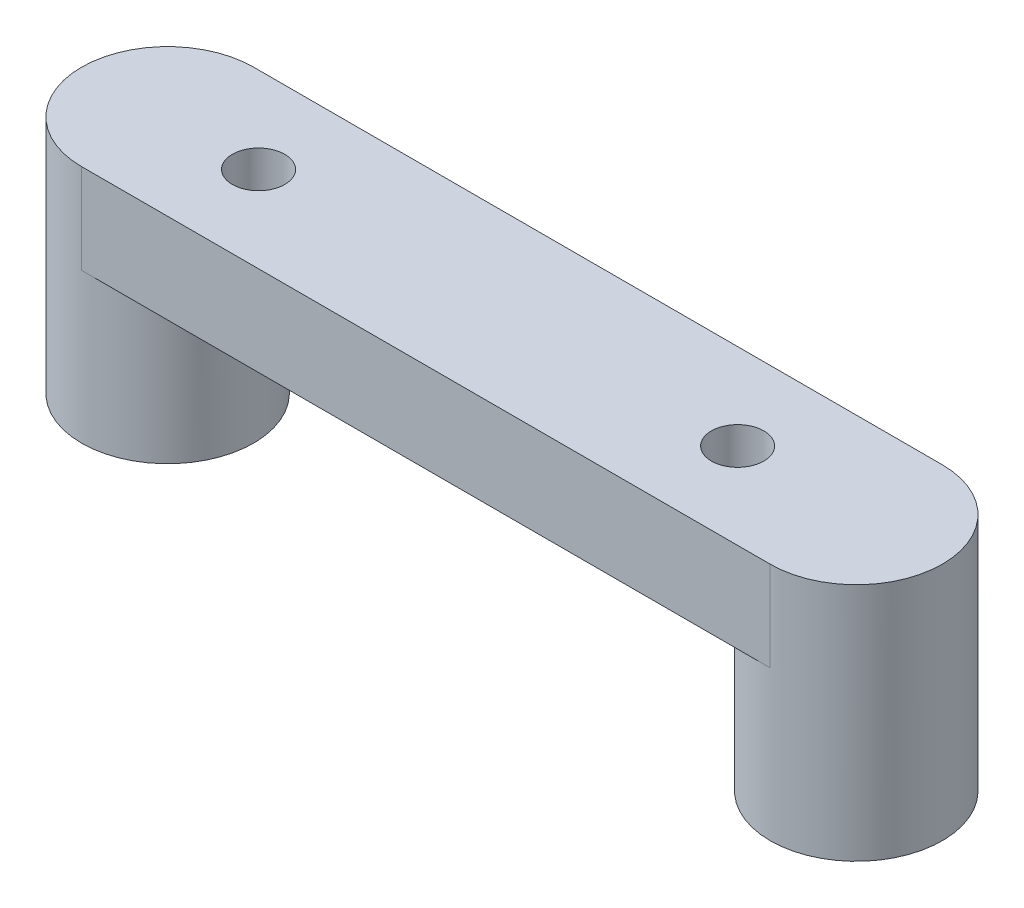
ISO-10303-21;
HEADER;
FILE_DESCRIPTION(('STEP AP214'),'2;1');
FILE_NAME('part.step','',(''),(''),'','','');
FILE_SCHEMA(('AUTOMOTIVE_DESIGN { 1 0 10303 214 1 1 1 1 }'));
ENDSEC;
DATA;
#1=APPLICATION_CONTEXT('core data for automotive mechanical design processes');
#2=APPLICATION_PROTOCOL_DEFINITION('international standard','automotive_design',2000,#1);
#3=PRODUCT_CONTEXT('',#1,'mechanical');
#4=PRODUCT('Part','Part','',(#3));
#5=PRODUCT_RELATED_PRODUCT_CATEGORY('part','',(#4));
#6=PRODUCT_DEFINITION_FORMATION('','',#4);
#7=PRODUCT_DEFINITION_CONTEXT('part definition',#1,'design');
#8=PRODUCT_DEFINITION('design','',#6,#7);
#9=PRODUCT_DEFINITION_SHAPE('','',#8);
#10=(LENGTH_UNIT() NAMED_UNIT(*) SI_UNIT(.MILLI.,.METRE.));
#11=(NAMED_UNIT(*) PLANE_ANGLE_UNIT() SI_UNIT($,.RADIAN.));
#12=(NAMED_UNIT(*) SI_UNIT($,.STERADIAN.) SOLID_ANGLE_UNIT());
#13=UNCERTAINTY_MEASURE_WITH_UNIT(LENGTH_MEASURE(1.E-05),#10,'distance_accuracy_value','');
#14=(GEOMETRIC_REPRESENTATION_CONTEXT(3) GLOBAL_UNCERTAINTY_ASSIGNED_CONTEXT((#13)) GLOBAL_UNIT_ASSIGNED_CONTEXT((#10,
#11,#12)) REPRESENTATION_CONTEXT('',''));
#15=CARTESIAN_POINT('',(0.,0.,0.));
#16=DIRECTION('',(0.,0.,1.));
#17=DIRECTION('',(1.,0.,0.));
#18=AXIS2_PLACEMENT_3D('',#15,#16,#17);
#19=CARTESIAN_POINT('',(-11.5,5.,0.));
#20=DIRECTION('',(0.,-1.,0.));
#21=DIRECTION('',(0.,0.,-1.));
#22=AXIS2_PLACEMENT_3D('',#19,#20,#21);
#23=CYLINDRICAL_SURFACE('',#22,0.875);
#24=CARTESIAN_POINT('',(-11.5,5.,0.));
#25=DIRECTION('',(0.,1.,0.));
#26=DIRECTION('',(0.,0.,1.));
#27=AXIS2_PLACEMENT_3D('',#24,#25,#26);
#28=CIRCLE('',#27,0.875);
#29=CARTESIAN_POINT('',(-11.5,5.,0.875000000000004));
#30=VERTEX_POINT('',#29);
#31=EDGE_CURVE('E108',#30,#30,#28,.T.);
#32=ORIENTED_EDGE('',*,*,#31,.T.);
#33=EDGE_LOOP('',(#32));
#34=FACE_BOUND('',#33,.T.);
#35=CARTESIAN_POINT('',(-11.5,0.,0.));
#36=DIRECTION('',(0.,1.,0.));
#37=DIRECTION('',(0.,0.,1.));
#38=AXIS2_PLACEMENT_3D('',#35,#36,#37);
#39=CIRCLE('',#38,0.875);
#40=CARTESIAN_POINT('',(-11.5,0.,0.875000000000004));
#41=VERTEX_POINT('',#40);
#42=EDGE_CURVE('E104',#41,#41,#39,.T.);
#43=ORIENTED_EDGE('',*,*,#42,.F.);
#44=EDGE_LOOP('',(#43));
#45=FACE_BOUND('',#44,.T.);
#46=ADVANCED_FACE('F35',(#34,#45),#23,.F.);
#47=CARTESIAN_POINT('',(-11.5,5.,0.));
#48=DIRECTION('',(0.,-1.,0.));
#49=DIRECTION('',(0.,0.,-1.));
#50=AXIS2_PLACEMENT_3D('',#47,#48,#49);
#51=CYLINDRICAL_SURFACE('',#50,2.875);
#52=CARTESIAN_POINT('',(-11.5,5.,0.));
#53=DIRECTION('',(0.,1.,0.));
#54=DIRECTION('',(0.,0.,1.));
#55=AXIS2_PLACEMENT_3D('',#52,#53,#54);
#56=CIRCLE('',#55,2.875);
#57=CARTESIAN_POINT('',(-11.5,5.,2.87500000000001));
#58=VERTEX_POINT('',#57);
#59=CARTESIAN_POINT('',(-8.74669953330527,5.,0.827624033060045));
#60=VERTEX_POINT('',#59);
#61=EDGE_CURVE('E93',#58,#60,#56,.T.);
#62=ORIENTED_EDGE('',*,*,#61,.F.);
#63=DIRECTION('',(0.,-1.,0.));
#64=VECTOR('',#63,1.);
#65=CARTESIAN_POINT('',(-11.5,8.,2.87500000000001));
#66=LINE('',#65,#64);
#67=CARTESIAN_POINT('',(-11.5,8.,2.87500000000001));
#68=VERTEX_POINT('',#67);
#69=EDGE_CURVE('E112',#68,#58,#66,.T.);
#70=ORIENTED_EDGE('',*,*,#69,.F.);
#71=CARTESIAN_POINT('',(-11.5,8.,0.));
#72=DIRECTION('',(0.,1.,0.));
#73=DIRECTION('',(0.,0.,1.));
#74=AXIS2_PLACEMENT_3D('',#71,#72,#73);
#75=CIRCLE('',#74,2.875);
#76=CARTESIAN_POINT('',(-11.5,8.,-2.875));
#77=VERTEX_POINT('',#76);
#78=EDGE_CURVE('E128',#77,#68,#75,.T.);
#79=ORIENTED_EDGE('',*,*,#78,.F.);
#80=DIRECTION('',(0.,-1.,0.));
#81=VECTOR('',#80,1.);
#82=CARTESIAN_POINT('',(-11.5,8.,-2.875));
#83=LINE('',#82,#81);
#84=CARTESIAN_POINT('',(-11.5,5.,-2.875));
#85=VERTEX_POINT('',#84);
#86=EDGE_CURVE('E123',#77,#85,#83,.T.);
#87=ORIENTED_EDGE('',*,*,#86,.T.);
#88=CARTESIAN_POINT('',(-8.74669953330527,5.,-0.827624033060045));
#89=VERTEX_POINT('',#88);
#90=EDGE_CURVE('E55',#89,#85,#56,.T.);
#91=ORIENTED_EDGE('',*,*,#90,.F.);
#92=EDGE_CURVE('E85',#60,#89,#56,.T.);
#93=ORIENTED_EDGE('',*,*,#92,.F.);
#94=EDGE_LOOP('',(#62,#70,#79,#87,#91,#93));
#95=FACE_BOUND('',#94,.T.);
#96=CARTESIAN_POINT('',(-11.5,0.,0.));
#97=DIRECTION('',(0.,1.,0.));
#98=DIRECTION('',(0.,0.,1.));
#99=AXIS2_PLACEMENT_3D('',#96,#97,#98);
#100=CIRCLE('',#99,2.875);
#101=CARTESIAN_POINT('',(-11.5,0.,2.87500000000001));
#102=VERTEX_POINT('',#101);
#103=EDGE_CURVE('E102',#102,#102,#100,.T.);
#104=ORIENTED_EDGE('',*,*,#103,.T.);
#105=EDGE_LOOP('',(#104));
#106=FACE_BOUND('',#105,.T.);
#107=ADVANCED_FACE('F90',(#95,#106),#51,.T.);
#108=CARTESIAN_POINT('',(0.,0.,0.));
#109=DIRECTION('',(0.,1.,0.));
#110=DIRECTION('',(0.,0.,1.));
#111=AXIS2_PLACEMENT_3D('',#108,#109,#110);
#112=PLANE('',#111);
#113=ORIENTED_EDGE('',*,*,#42,.T.);
#114=EDGE_LOOP('',(#113));
#115=FACE_BOUND('',#114,.T.);
#116=ORIENTED_EDGE('',*,*,#103,.F.);
#117=EDGE_LOOP('',(#116));
#118=FACE_BOUND('',#117,.T.);
#119=ADVANCED_FACE('F159',(#115,#118),#112,.F.);
#120=CARTESIAN_POINT('',(0.,8.,0.));
#121=DIRECTION('',(0.,1.,0.));
#122=DIRECTION('',(0.,0.,1.));
#123=AXIS2_PLACEMENT_3D('',#120,#121,#122);
#124=PLANE('',#123);
#125=CARTESIAN_POINT('',(-8.46268639997967,8.,0.));
#126=DIRECTION('',(0.,1.,0.));
#127=DIRECTION('',(0.,0.,1.));
#128=AXIS2_PLACEMENT_3D('',#125,#126,#127);
#129=CIRCLE('',#128,0.875);
#130=CARTESIAN_POINT('',(-8.46268639997967,8.,0.875));
#131=VERTEX_POINT('',#130);
#132=EDGE_CURVE('E87',#131,#131,#129,.T.);
#133=ORIENTED_EDGE('',*,*,#132,.F.);
#134=EDGE_LOOP('',(#133));
#135=FACE_BOUND('',#134,.T.);
#136=CARTESIAN_POINT('',(7.53717549385542,8.,0.));
#137=DIRECTION('',(0.,1.,0.));
#138=DIRECTION('',(0.,0.,1.));
#139=AXIS2_PLACEMENT_3D('',#136,#137,#138);
#140=CIRCLE('',#139,0.874999999999999);
#141=CARTESIAN_POINT('',(7.53717549385542,8.,0.874999999999999));
#142=VERTEX_POINT('',#141);
#143=EDGE_CURVE('E149',#142,#142,#140,.T.);
#144=ORIENTED_EDGE('',*,*,#143,.F.);
#145=EDGE_LOOP('',(#144));
#146=FACE_BOUND('',#145,.T.);
#147=ORIENTED_EDGE('',*,*,#78,.T.);
#148=DIRECTION('',(1.,0.,0.));
#149=VECTOR('',#148,1.);
#150=CARTESIAN_POINT('',(0.,8.,2.875));
#151=LINE('',#150,#149);
#152=CARTESIAN_POINT('',(11.5,8.,2.875));
#153=VERTEX_POINT('',#152);
#154=EDGE_CURVE('E135',#68,#153,#151,.T.);
#155=ORIENTED_EDGE('',*,*,#154,.T.);
#156=CARTESIAN_POINT('',(11.5,8.,0.));
#157=DIRECTION('',(0.,1.,0.));
#158=DIRECTION('',(0.,0.,1.));
#159=AXIS2_PLACEMENT_3D('',#156,#157,#158);
#160=CIRCLE('',#159,2.87499999999999);
#161=CARTESIAN_POINT('',(11.5,8.,-2.875));
#162=VERTEX_POINT('',#161);
#163=EDGE_CURVE('E133',#153,#162,#160,.T.);
#164=ORIENTED_EDGE('',*,*,#163,.T.);
#165=DIRECTION('',(1.,0.,0.));
#166=VECTOR('',#165,1.);
#167=CARTESIAN_POINT('',(0.,8.,-2.875));
#168=LINE('',#167,#166);
#169=EDGE_CURVE('E125',#77,#162,#168,.T.);
#170=ORIENTED_EDGE('',*,*,#169,.F.);
#171=EDGE_LOOP('',(#147,#155,#164,#170));
#172=FACE_BOUND('',#171,.T.);
#173=ADVANCED_FACE('F155',(#135,#146,#172),#124,.T.);
#174=CARTESIAN_POINT('',(0.,8.,-2.875));
#175=DIRECTION('',(0.,0.,-1.));
#176=DIRECTION('',(-1.,0.,0.));
#177=AXIS2_PLACEMENT_3D('',#174,#175,#176);
#178=PLANE('',#177);
#179=DIRECTION('',(1.,0.,0.));
#180=VECTOR('',#179,1.);
#181=CARTESIAN_POINT('',(0.,5.,-2.875));
#182=LINE('',#181,#180);
#183=CARTESIAN_POINT('',(11.5,5.,-2.875));
#184=VERTEX_POINT('',#183);
#185=EDGE_CURVE('E126',#85,#184,#182,.T.);
#186=ORIENTED_EDGE('',*,*,#185,.F.);
#187=ORIENTED_EDGE('',*,*,#86,.F.);
#188=ORIENTED_EDGE('',*,*,#169,.T.);
#189=DIRECTION('',(0.,-1.,0.));
#190=VECTOR('',#189,1.);
#191=CARTESIAN_POINT('',(11.5,8.,-2.875));
#192=LINE('',#191,#190);
#193=EDGE_CURVE('E120',#162,#184,#192,.T.);
#194=ORIENTED_EDGE('',*,*,#193,.T.);
#195=EDGE_LOOP('',(#186,#187,#188,#194));
#196=FACE_BOUND('',#195,.T.);
#197=ADVANCED_FACE('F158',(#196),#178,.T.);
#198=CARTESIAN_POINT('',(11.5,8.,0.));
#199=DIRECTION('',(0.,-1.,0.));
#200=DIRECTION('',(0.,0.,-1.));
#201=AXIS2_PLACEMENT_3D('',#198,#199,#200);
#202=CYLINDRICAL_SURFACE('',#201,2.87499999999999);
#203=DIRECTION('',(0.,-1.,0.));
#204=VECTOR('',#203,1.);
#205=CARTESIAN_POINT('',(11.5,8.,2.875));
#206=LINE('',#205,#204);
#207=CARTESIAN_POINT('',(11.5,5.,2.875));
#208=VERTEX_POINT('',#207);
#209=EDGE_CURVE('E115',#153,#208,#206,.T.);
#210=ORIENTED_EDGE('',*,*,#209,.T.);
#211=CARTESIAN_POINT('',(11.5,5.,0.));
#212=DIRECTION('',(0.,1.,0.));
#213=DIRECTION('',(0.,0.,1.));
#214=AXIS2_PLACEMENT_3D('',#211,#212,#213);
#215=CIRCLE('',#214,2.875);
#216=EDGE_CURVE('E42',#208,#184,#215,.F.);
#217=ORIENTED_EDGE('',*,*,#216,.T.);
#218=ORIENTED_EDGE('',*,*,#193,.F.);
#219=ORIENTED_EDGE('',*,*,#163,.F.);
#220=EDGE_LOOP('',(#210,#217,#218,#219));
#221=FACE_BOUND('',#220,.T.);
#222=CARTESIAN_POINT('',(11.5,0.,0.));
#223=DIRECTION('',(0.,1.,0.));
#224=DIRECTION('',(0.,0.,1.));
#225=AXIS2_PLACEMENT_3D('',#222,#223,#224);
#226=CIRCLE('',#225,2.875);
#227=CARTESIAN_POINT('',(11.5,0.,2.875));
#228=VERTEX_POINT('',#227);
#229=EDGE_CURVE('E86',#228,#228,#226,.T.);
#230=ORIENTED_EDGE('',*,*,#229,.T.);
#231=EDGE_LOOP('',(#230));
#232=FACE_BOUND('',#231,.T.);
#233=ADVANCED_FACE('F171',(#221,#232),#202,.T.);
#234=CARTESIAN_POINT('',(0.,8.,2.875));
#235=DIRECTION('',(0.,0.,-1.));
#236=DIRECTION('',(-1.,0.,0.));
#237=AXIS2_PLACEMENT_3D('',#234,#235,#236);
#238=PLANE('',#237);
#239=DIRECTION('',(1.,0.,0.));
#240=VECTOR('',#239,1.);
#241=CARTESIAN_POINT('',(0.,5.,2.875));
#242=LINE('',#241,#240);
#243=EDGE_CURVE('E98',#58,#208,#242,.T.);
#244=ORIENTED_EDGE('',*,*,#243,.T.);
#245=ORIENTED_EDGE('',*,*,#209,.F.);
#246=ORIENTED_EDGE('',*,*,#154,.F.);
#247=ORIENTED_EDGE('',*,*,#69,.T.);
#248=EDGE_LOOP('',(#244,#245,#246,#247));
#249=FACE_BOUND('',#248,.T.);
#250=ADVANCED_FACE('F167',(#249),#238,.F.);
#251=CARTESIAN_POINT('',(0.,5.,0.));
#252=DIRECTION('',(0.,1.,0.));
#253=DIRECTION('',(0.,0.,1.));
#254=AXIS2_PLACEMENT_3D('',#251,#252,#253);
#255=PLANE('',#254);
#256=CARTESIAN_POINT('',(7.53717549385542,5.,0.));
#257=DIRECTION('',(0.,1.,0.));
#258=DIRECTION('',(0.,0.,1.));
#259=AXIS2_PLACEMENT_3D('',#256,#257,#258);
#260=CIRCLE('',#259,0.874999999999999);
#261=CARTESIAN_POINT('',(7.53717549385542,5.,0.874999999999999));
#262=VERTEX_POINT('',#261);
#263=EDGE_CURVE('E146',#262,#262,#260,.F.);
#264=ORIENTED_EDGE('',*,*,#263,.F.);
#265=EDGE_LOOP('',(#264));
#266=FACE_BOUND('',#265,.T.);
#267=ORIENTED_EDGE('',*,*,#61,.T.);
#268=CARTESIAN_POINT('',(-8.46268639997967,5.,0.));
#269=DIRECTION('',(0.,1.,0.));
#270=DIRECTION('',(0.,0.,1.));
#271=AXIS2_PLACEMENT_3D('',#268,#269,#270);
#272=CIRCLE('',#271,0.875);
#273=EDGE_CURVE('E11',#60,#89,#272,.T.);
#274=ORIENTED_EDGE('',*,*,#273,.T.);
#275=ORIENTED_EDGE('',*,*,#90,.T.);
#276=ORIENTED_EDGE('',*,*,#185,.T.);
#277=ORIENTED_EDGE('',*,*,#216,.F.);
#278=ORIENTED_EDGE('',*,*,#243,.F.);
#279=EDGE_LOOP('',(#267,#274,#275,#276,#277,#278));
#280=FACE_BOUND('',#279,.T.);
#281=ADVANCED_FACE('F96',(#266,#280),#255,.F.);
#282=ORIENTED_EDGE('',*,*,#31,.F.);
#283=EDGE_LOOP('',(#282));
#284=FACE_BOUND('',#283,.T.);
#285=ADVANCED_FACE('F196',(#284),#255,.F.);
#286=CARTESIAN_POINT('',(11.5,5.,0.));
#287=DIRECTION('',(0.,-1.,0.));
#288=DIRECTION('',(0.,0.,-1.));
#289=AXIS2_PLACEMENT_3D('',#286,#287,#288);
#290=CYLINDRICAL_SURFACE('',#289,0.875);
#291=CARTESIAN_POINT('',(11.5,5.,0.));
#292=DIRECTION('',(0.,1.,0.));
#293=DIRECTION('',(0.,0.,1.));
#294=AXIS2_PLACEMENT_3D('',#291,#292,#293);
#295=CIRCLE('',#294,0.875);
#296=CARTESIAN_POINT('',(11.5,5.,0.874999999999996));
#297=VERTEX_POINT('',#296);
#298=EDGE_CURVE('E130',#297,#297,#295,.T.);
#299=ORIENTED_EDGE('',*,*,#298,.T.);
#300=EDGE_LOOP('',(#299));
#301=FACE_BOUND('',#300,.T.);
#302=CARTESIAN_POINT('',(11.5,0.,0.));
#303=DIRECTION('',(0.,1.,0.));
#304=DIRECTION('',(0.,0.,1.));
#305=AXIS2_PLACEMENT_3D('',#302,#303,#304);
#306=CIRCLE('',#305,0.875);
#307=CARTESIAN_POINT('',(11.5,0.,0.874999999999996));
#308=VERTEX_POINT('',#307);
#309=EDGE_CURVE('E139',#308,#308,#306,.T.);
#310=ORIENTED_EDGE('',*,*,#309,.F.);
#311=EDGE_LOOP('',(#310));
#312=FACE_BOUND('',#311,.T.);
#313=ADVANCED_FACE('F202',(#301,#312),#290,.F.);
#314=CARTESIAN_POINT('',(0.,0.,0.));
#315=DIRECTION('',(0.,1.,0.));
#316=DIRECTION('',(0.,0.,1.));
#317=AXIS2_PLACEMENT_3D('',#314,#315,#316);
#318=PLANE('',#317);
#319=ORIENTED_EDGE('',*,*,#229,.F.);
#320=EDGE_LOOP('',(#319));
#321=FACE_BOUND('',#320,.T.);
#322=ORIENTED_EDGE('',*,*,#309,.T.);
#323=EDGE_LOOP('',(#322));
#324=FACE_BOUND('',#323,.T.);
#325=ADVANCED_FACE('F207',(#321,#324),#318,.F.);
#326=ORIENTED_EDGE('',*,*,#298,.F.);
#327=EDGE_LOOP('',(#326));
#328=FACE_BOUND('',#327,.T.);
#329=ADVANCED_FACE('F198',(#328),#255,.F.);
#330=CARTESIAN_POINT('',(7.53717549385542,2.52512626584708,0.));
#331=DIRECTION('',(0.,1.,0.));
#332=DIRECTION('',(0.,0.,1.));
#333=AXIS2_PLACEMENT_3D('',#330,#331,#332);
#334=CYLINDRICAL_SURFACE('',#333,0.874999999999999);
#335=ORIENTED_EDGE('',*,*,#263,.T.);
#336=EDGE_LOOP('',(#335));
#337=FACE_BOUND('',#336,.T.);
#338=ORIENTED_EDGE('',*,*,#143,.T.);
#339=EDGE_LOOP('',(#338));
#340=FACE_BOUND('',#339,.T.);
#341=ADVANCED_FACE('F206',(#337,#340),#334,.F.);
#342=CARTESIAN_POINT('',(0.,5.,0.));
#343=DIRECTION('',(0.,1.,0.));
#344=DIRECTION('',(0.,0.,1.));
#345=AXIS2_PLACEMENT_3D('',#342,#343,#344);
#346=PLANE('',#345);
#347=ORIENTED_EDGE('',*,*,#92,.T.);
#348=CARTESIAN_POINT('',(-8.46268639997967,5.,0.));
#349=DIRECTION('',(0.,1.,0.));
#350=DIRECTION('',(0.,0.,1.));
#351=AXIS2_PLACEMENT_3D('',#348,#349,#350);
#352=CIRCLE('',#351,0.875);
#353=EDGE_CURVE('E48',#60,#89,#352,.F.);
#354=ORIENTED_EDGE('',*,*,#353,.F.);
#355=EDGE_LOOP('',(#347,#354));
#356=FACE_BOUND('',#355,.T.);
#357=ADVANCED_FACE('F84',(#356),#346,.T.);
#358=CARTESIAN_POINT('',(-8.46268639997967,2.52512626584708,0.));
#359=DIRECTION('',(0.,1.,0.));
#360=DIRECTION('',(0.,0.,1.));
#361=AXIS2_PLACEMENT_3D('',#358,#359,#360);
#362=CYLINDRICAL_SURFACE('',#361,0.875);
#363=ORIENTED_EDGE('',*,*,#353,.T.);
#364=ORIENTED_EDGE('',*,*,#273,.F.);
#365=EDGE_LOOP('',(#363,#364));
#366=FACE_BOUND('',#365,.T.);
#367=ORIENTED_EDGE('',*,*,#132,.T.);
#368=EDGE_LOOP('',(#367));
#369=FACE_BOUND('',#368,.T.);
#370=ADVANCED_FACE('F79',(#366,#369),#362,.F.);
#371=CLOSED_SHELL('',(#46,#107,#119,#173,#197,#233,#250,#281,#285,#313,#325,#329,#341,#357,#370));
#372=MANIFOLD_SOLID_BREP('B2',#371);
#373=ADVANCED_BREP_SHAPE_REPRESENTATION('',(#18,#372),#14);
#374=SHAPE_DEFINITION_REPRESENTATION(#9,#373);
ENDSEC;
END-ISO-10303-21;
